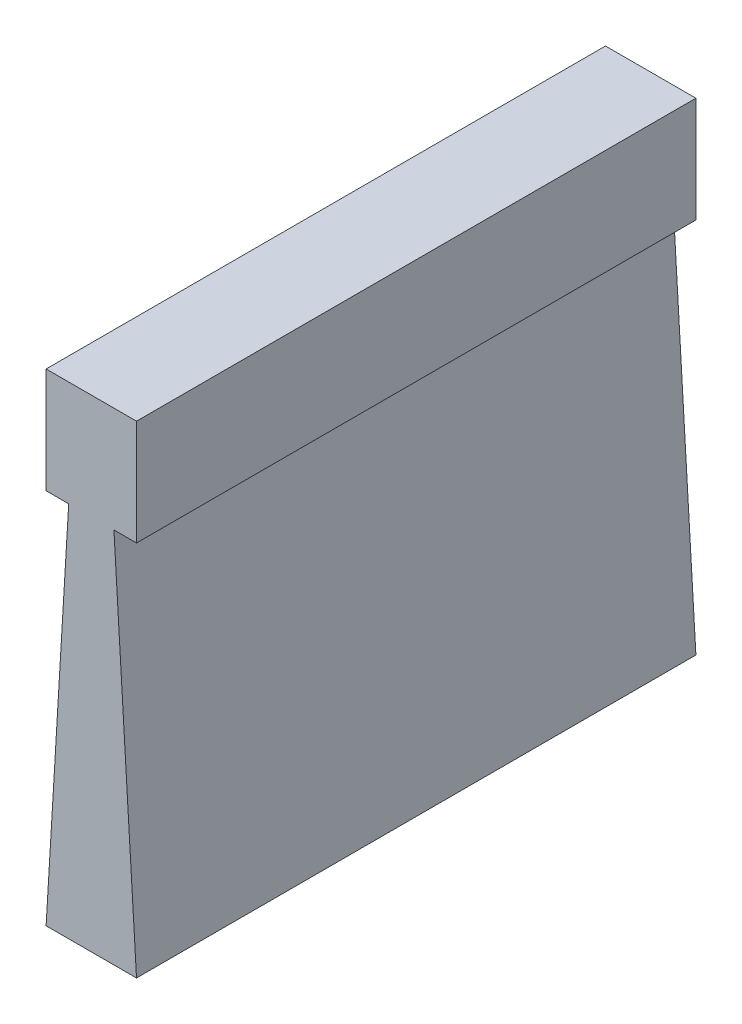
ISO-10303-21;
HEADER;
FILE_DESCRIPTION(('STEP AP214'),'2;1');
FILE_NAME('part.step','',(''),(''),'','','');
FILE_SCHEMA(('AUTOMOTIVE_DESIGN { 1 0 10303 214 1 1 1 1 }'));
ENDSEC;
DATA;
#1=APPLICATION_CONTEXT('core data for automotive mechanical design processes');
#2=APPLICATION_PROTOCOL_DEFINITION('international standard','automotive_design',2000,#1);
#3=PRODUCT_CONTEXT('',#1,'mechanical');
#4=PRODUCT('Part','Part','',(#3));
#5=PRODUCT_RELATED_PRODUCT_CATEGORY('part','',(#4));
#6=PRODUCT_DEFINITION_FORMATION('','',#4);
#7=PRODUCT_DEFINITION_CONTEXT('part definition',#1,'design');
#8=PRODUCT_DEFINITION('design','',#6,#7);
#9=PRODUCT_DEFINITION_SHAPE('','',#8);
#10=(LENGTH_UNIT() NAMED_UNIT(*) SI_UNIT(.MILLI.,.METRE.));
#11=(NAMED_UNIT(*) PLANE_ANGLE_UNIT() SI_UNIT($,.RADIAN.));
#12=(NAMED_UNIT(*) SI_UNIT($,.STERADIAN.) SOLID_ANGLE_UNIT());
#13=UNCERTAINTY_MEASURE_WITH_UNIT(LENGTH_MEASURE(1.E-05),#10,'distance_accuracy_value','');
#14=(GEOMETRIC_REPRESENTATION_CONTEXT(3) GLOBAL_UNCERTAINTY_ASSIGNED_CONTEXT((#13)) GLOBAL_UNIT_ASSIGNED_CONTEXT((#10,
#11,#12)) REPRESENTATION_CONTEXT('',''));
#15=CARTESIAN_POINT('',(0.,0.,0.));
#16=DIRECTION('',(0.,0.,1.));
#17=DIRECTION('',(1.,0.,0.));
#18=AXIS2_PLACEMENT_3D('',#15,#16,#17);
#19=CARTESIAN_POINT('',(-1.190625,0.,14.732));
#20=DIRECTION('',(0.998204845465779,-0.0598922907279466,0.));
#21=DIRECTION('',(0.0598922907279466,0.998204845465779,0.));
#22=AXIS2_PLACEMENT_3D('',#19,#20,#21);
#23=PLANE('',#22);
#24=DIRECTION('',(-0.0598922907279466,-0.998204845465779,0.));
#25=VECTOR('',#24,1.);
#26=CARTESIAN_POINT('',(-1.190625,0.,-14.732));
#27=LINE('',#26,#25);
#28=CARTESIAN_POINT('',(-1.190625,0.,-14.732));
#29=VERTEX_POINT('',#28);
#30=CARTESIAN_POINT('',(-2.38125,-19.84375,-14.732));
#31=VERTEX_POINT('',#30);
#32=EDGE_CURVE('E130',#29,#31,#27,.T.);
#33=ORIENTED_EDGE('',*,*,#32,.T.);
#34=DIRECTION('',(0.,0.,-1.));
#35=VECTOR('',#34,1.);
#36=CARTESIAN_POINT('',(-2.38125,-19.84375,14.732));
#37=LINE('',#36,#35);
#38=CARTESIAN_POINT('',(-2.38125,-19.84375,14.732));
#39=VERTEX_POINT('',#38);
#40=EDGE_CURVE('E11',#39,#31,#37,.T.);
#41=ORIENTED_EDGE('',*,*,#40,.F.);
#42=DIRECTION('',(-0.0598922907279466,-0.998204845465779,0.));
#43=VECTOR('',#42,1.);
#44=CARTESIAN_POINT('',(-1.190625,0.,14.732));
#45=LINE('',#44,#43);
#46=CARTESIAN_POINT('',(-1.190625,0.,14.732));
#47=VERTEX_POINT('',#46);
#48=EDGE_CURVE('E144',#47,#39,#45,.T.);
#49=ORIENTED_EDGE('',*,*,#48,.F.);
#50=DIRECTION('',(0.,0.,-1.));
#51=VECTOR('',#50,1.);
#52=CARTESIAN_POINT('',(-1.190625,0.,14.732));
#53=LINE('',#52,#51);
#54=EDGE_CURVE('E126',#47,#29,#53,.T.);
#55=ORIENTED_EDGE('',*,*,#54,.T.);
#56=EDGE_LOOP('',(#33,#41,#49,#55));
#57=FACE_BOUND('',#56,.T.);
#58=ADVANCED_FACE('F34',(#57),#23,.F.);
#59=CARTESIAN_POINT('',(-2.38125,-19.84375,14.732));
#60=DIRECTION('',(0.,1.,0.));
#61=DIRECTION('',(0.,0.,1.));
#62=AXIS2_PLACEMENT_3D('',#59,#60,#61);
#63=PLANE('',#62);
#64=DIRECTION('',(1.,0.,0.));
#65=VECTOR('',#64,1.);
#66=CARTESIAN_POINT('',(-2.38125,-19.84375,-14.732));
#67=LINE('',#66,#65);
#68=CARTESIAN_POINT('',(2.38125,-19.84375,-14.732));
#69=VERTEX_POINT('',#68);
#70=EDGE_CURVE('E133',#31,#69,#67,.T.);
#71=ORIENTED_EDGE('',*,*,#70,.T.);
#72=DIRECTION('',(0.,0.,-1.));
#73=VECTOR('',#72,1.);
#74=CARTESIAN_POINT('',(2.38125,-19.84375,14.732));
#75=LINE('',#74,#73);
#76=CARTESIAN_POINT('',(2.38125,-19.84375,14.732));
#77=VERTEX_POINT('',#76);
#78=EDGE_CURVE('E42',#77,#69,#75,.T.);
#79=ORIENTED_EDGE('',*,*,#78,.F.);
#80=DIRECTION('',(1.,0.,0.));
#81=VECTOR('',#80,1.);
#82=CARTESIAN_POINT('',(-2.38125,-19.84375,14.732));
#83=LINE('',#82,#81);
#84=EDGE_CURVE('E93',#39,#77,#83,.T.);
#85=ORIENTED_EDGE('',*,*,#84,.F.);
#86=ORIENTED_EDGE('',*,*,#40,.T.);
#87=EDGE_LOOP('',(#71,#79,#85,#86));
#88=FACE_BOUND('',#87,.T.);
#89=ADVANCED_FACE('F179',(#88),#63,.F.);
#90=CARTESIAN_POINT('',(1.190625,0.,14.732));
#91=DIRECTION('',(-0.998204845465779,-0.0598922907279469,0.));
#92=DIRECTION('',(0.0598922907279469,-0.998204845465779,0.));
#93=AXIS2_PLACEMENT_3D('',#90,#91,#92);
#94=PLANE('',#93);
#95=DIRECTION('',(-0.0598922907279469,0.998204845465779,0.));
#96=VECTOR('',#95,1.);
#97=CARTESIAN_POINT('',(1.190625,0.,-14.732));
#98=LINE('',#97,#96);
#99=CARTESIAN_POINT('',(1.190625,0.,-14.732));
#100=VERTEX_POINT('',#99);
#101=EDGE_CURVE('E135',#69,#100,#98,.T.);
#102=ORIENTED_EDGE('',*,*,#101,.T.);
#103=DIRECTION('',(0.,0.,-1.));
#104=VECTOR('',#103,1.);
#105=CARTESIAN_POINT('',(1.190625,0.,14.732));
#106=LINE('',#105,#104);
#107=CARTESIAN_POINT('',(1.190625,0.,14.732));
#108=VERTEX_POINT('',#107);
#109=EDGE_CURVE('E151',#108,#100,#106,.T.);
#110=ORIENTED_EDGE('',*,*,#109,.F.);
#111=DIRECTION('',(-0.0598922907279469,0.998204845465779,0.));
#112=VECTOR('',#111,1.);
#113=CARTESIAN_POINT('',(1.190625,0.,14.732));
#114=LINE('',#113,#112);
#115=EDGE_CURVE('E159',#77,#108,#114,.T.);
#116=ORIENTED_EDGE('',*,*,#115,.F.);
#117=ORIENTED_EDGE('',*,*,#78,.T.);
#118=EDGE_LOOP('',(#102,#110,#116,#117));
#119=FACE_BOUND('',#118,.T.);
#120=ADVANCED_FACE('F157',(#119),#94,.F.);
#121=CARTESIAN_POINT('',(1.190625,0.,14.732));
#122=DIRECTION('',(0.,1.,0.));
#123=DIRECTION('',(-1.,0.,0.));
#124=AXIS2_PLACEMENT_3D('',#121,#122,#123);
#125=PLANE('',#124);
#126=DIRECTION('',(1.,0.,0.));
#127=VECTOR('',#126,1.);
#128=CARTESIAN_POINT('',(1.190625,0.,-14.732));
#129=LINE('',#128,#127);
#130=CARTESIAN_POINT('',(2.38125,0.,-14.732));
#131=VERTEX_POINT('',#130);
#132=EDGE_CURVE('E137',#100,#131,#129,.T.);
#133=ORIENTED_EDGE('',*,*,#132,.T.);
#134=DIRECTION('',(0.,0.,-1.));
#135=VECTOR('',#134,1.);
#136=CARTESIAN_POINT('',(2.38125,0.,14.732));
#137=LINE('',#136,#135);
#138=CARTESIAN_POINT('',(2.38125,0.,14.732));
#139=VERTEX_POINT('',#138);
#140=EDGE_CURVE('E148',#139,#131,#137,.T.);
#141=ORIENTED_EDGE('',*,*,#140,.F.);
#142=DIRECTION('',(1.,0.,0.));
#143=VECTOR('',#142,1.);
#144=CARTESIAN_POINT('',(1.190625,0.,14.732));
#145=LINE('',#144,#143);
#146=EDGE_CURVE('E171',#108,#139,#145,.T.);
#147=ORIENTED_EDGE('',*,*,#146,.F.);
#148=ORIENTED_EDGE('',*,*,#109,.T.);
#149=EDGE_LOOP('',(#133,#141,#147,#148));
#150=FACE_BOUND('',#149,.T.);
#151=ADVANCED_FACE('F167',(#150),#125,.F.);
#152=CARTESIAN_POINT('',(2.38125,5.55625,14.732));
#153=DIRECTION('',(-1.,0.,0.));
#154=DIRECTION('',(0.,0.,1.));
#155=AXIS2_PLACEMENT_3D('',#152,#153,#154);
#156=PLANE('',#155);
#157=DIRECTION('',(0.,1.,0.));
#158=VECTOR('',#157,1.);
#159=CARTESIAN_POINT('',(2.38125,5.55625,-14.732));
#160=LINE('',#159,#158);
#161=CARTESIAN_POINT('',(2.38125,5.55625,-14.732));
#162=VERTEX_POINT('',#161);
#163=EDGE_CURVE('E139',#131,#162,#160,.T.);
#164=ORIENTED_EDGE('',*,*,#163,.T.);
#165=DIRECTION('',(0.,0.,-1.));
#166=VECTOR('',#165,1.);
#167=CARTESIAN_POINT('',(2.38125,5.55625,14.732));
#168=LINE('',#167,#166);
#169=CARTESIAN_POINT('',(2.38125,5.55625,14.732));
#170=VERTEX_POINT('',#169);
#171=EDGE_CURVE('E121',#170,#162,#168,.T.);
#172=ORIENTED_EDGE('',*,*,#171,.F.);
#173=DIRECTION('',(0.,1.,0.));
#174=VECTOR('',#173,1.);
#175=CARTESIAN_POINT('',(2.38125,5.55625,14.732));
#176=LINE('',#175,#174);
#177=EDGE_CURVE('E112',#139,#170,#176,.T.);
#178=ORIENTED_EDGE('',*,*,#177,.F.);
#179=ORIENTED_EDGE('',*,*,#140,.T.);
#180=EDGE_LOOP('',(#164,#172,#178,#179));
#181=FACE_BOUND('',#180,.T.);
#182=ADVANCED_FACE('F170',(#181),#156,.F.);
#183=CARTESIAN_POINT('',(-2.38125,5.55625,14.732));
#184=DIRECTION('',(0.,-1.,0.));
#185=DIRECTION('',(0.,0.,-1.));
#186=AXIS2_PLACEMENT_3D('',#183,#184,#185);
#187=PLANE('',#186);
#188=DIRECTION('',(-1.,0.,0.));
#189=VECTOR('',#188,1.);
#190=CARTESIAN_POINT('',(-2.38125,5.55625,-14.732));
#191=LINE('',#190,#189);
#192=CARTESIAN_POINT('',(-2.38125,5.55625,-14.732));
#193=VERTEX_POINT('',#192);
#194=EDGE_CURVE('E120',#162,#193,#191,.T.);
#195=ORIENTED_EDGE('',*,*,#194,.T.);
#196=DIRECTION('',(0.,0.,-1.));
#197=VECTOR('',#196,1.);
#198=CARTESIAN_POINT('',(-2.38125,5.55625,14.732));
#199=LINE('',#198,#197);
#200=CARTESIAN_POINT('',(-2.38125,5.55625,14.732));
#201=VERTEX_POINT('',#200);
#202=EDGE_CURVE('E117',#201,#193,#199,.T.);
#203=ORIENTED_EDGE('',*,*,#202,.F.);
#204=DIRECTION('',(-1.,0.,0.));
#205=VECTOR('',#204,1.);
#206=CARTESIAN_POINT('',(-2.38125,5.55625,14.732));
#207=LINE('',#206,#205);
#208=EDGE_CURVE('E106',#170,#201,#207,.T.);
#209=ORIENTED_EDGE('',*,*,#208,.F.);
#210=ORIENTED_EDGE('',*,*,#171,.T.);
#211=EDGE_LOOP('',(#195,#203,#209,#210));
#212=FACE_BOUND('',#211,.T.);
#213=ADVANCED_FACE('F118',(#212),#187,.F.);
#214=CARTESIAN_POINT('',(-2.38125,0.,14.732));
#215=DIRECTION('',(1.,0.,0.));
#216=DIRECTION('',(0.,0.,-1.));
#217=AXIS2_PLACEMENT_3D('',#214,#215,#216);
#218=PLANE('',#217);
#219=DIRECTION('',(0.,-1.,0.));
#220=VECTOR('',#219,1.);
#221=CARTESIAN_POINT('',(-2.38125,0.,-14.732));
#222=LINE('',#221,#220);
#223=CARTESIAN_POINT('',(-2.38125,0.,-14.732));
#224=VERTEX_POINT('',#223);
#225=EDGE_CURVE('E79',#193,#224,#222,.T.);
#226=ORIENTED_EDGE('',*,*,#225,.T.);
#227=DIRECTION('',(0.,0.,-1.));
#228=VECTOR('',#227,1.);
#229=CARTESIAN_POINT('',(-2.38125,0.,14.732));
#230=LINE('',#229,#228);
#231=CARTESIAN_POINT('',(-2.38125,0.,14.732));
#232=VERTEX_POINT('',#231);
#233=EDGE_CURVE('E122',#232,#224,#230,.T.);
#234=ORIENTED_EDGE('',*,*,#233,.F.);
#235=DIRECTION('',(0.,-1.,0.));
#236=VECTOR('',#235,1.);
#237=CARTESIAN_POINT('',(-2.38125,0.,14.732));
#238=LINE('',#237,#236);
#239=EDGE_CURVE('E110',#201,#232,#238,.T.);
#240=ORIENTED_EDGE('',*,*,#239,.F.);
#241=ORIENTED_EDGE('',*,*,#202,.T.);
#242=EDGE_LOOP('',(#226,#234,#240,#241));
#243=FACE_BOUND('',#242,.T.);
#244=ADVANCED_FACE('F124',(#243),#218,.F.);
#245=CARTESIAN_POINT('',(-1.190625,0.,14.732));
#246=DIRECTION('',(0.,1.,0.));
#247=DIRECTION('',(-1.,0.,0.));
#248=AXIS2_PLACEMENT_3D('',#245,#246,#247);
#249=PLANE('',#248);
#250=DIRECTION('',(1.,0.,0.));
#251=VECTOR('',#250,1.);
#252=CARTESIAN_POINT('',(-1.190625,0.,-14.732));
#253=LINE('',#252,#251);
#254=EDGE_CURVE('E85',#224,#29,#253,.T.);
#255=ORIENTED_EDGE('',*,*,#254,.T.);
#256=ORIENTED_EDGE('',*,*,#54,.F.);
#257=DIRECTION('',(1.,0.,0.));
#258=VECTOR('',#257,1.);
#259=CARTESIAN_POINT('',(-1.190625,0.,14.732));
#260=LINE('',#259,#258);
#261=EDGE_CURVE('E50',#232,#47,#260,.T.);
#262=ORIENTED_EDGE('',*,*,#261,.F.);
#263=ORIENTED_EDGE('',*,*,#233,.T.);
#264=EDGE_LOOP('',(#255,#256,#262,#263));
#265=FACE_BOUND('',#264,.T.);
#266=ADVANCED_FACE('F195',(#265),#249,.F.);
#267=CARTESIAN_POINT('',(-2.38125,-19.84375,14.732));
#268=DIRECTION('',(0.,0.,1.));
#269=DIRECTION('',(1.,0.,0.));
#270=AXIS2_PLACEMENT_3D('',#267,#268,#269);
#271=PLANE('',#270);
#272=ORIENTED_EDGE('',*,*,#48,.T.);
#273=ORIENTED_EDGE('',*,*,#84,.T.);
#274=ORIENTED_EDGE('',*,*,#115,.T.);
#275=ORIENTED_EDGE('',*,*,#146,.T.);
#276=ORIENTED_EDGE('',*,*,#177,.T.);
#277=ORIENTED_EDGE('',*,*,#208,.T.);
#278=ORIENTED_EDGE('',*,*,#239,.T.);
#279=ORIENTED_EDGE('',*,*,#261,.T.);
#280=EDGE_LOOP('',(#272,#273,#274,#275,#276,#277,#278,#279));
#281=FACE_BOUND('',#280,.T.);
#282=ADVANCED_FACE('F108',(#281),#271,.T.);
#283=CARTESIAN_POINT('',(-2.38125,-19.84375,-14.732));
#284=DIRECTION('',(0.,0.,1.));
#285=DIRECTION('',(1.,0.,0.));
#286=AXIS2_PLACEMENT_3D('',#283,#284,#285);
#287=PLANE('',#286);
#288=ORIENTED_EDGE('',*,*,#32,.F.);
#289=ORIENTED_EDGE('',*,*,#254,.F.);
#290=ORIENTED_EDGE('',*,*,#225,.F.);
#291=ORIENTED_EDGE('',*,*,#194,.F.);
#292=ORIENTED_EDGE('',*,*,#163,.F.);
#293=ORIENTED_EDGE('',*,*,#132,.F.);
#294=ORIENTED_EDGE('',*,*,#101,.F.);
#295=ORIENTED_EDGE('',*,*,#70,.F.);
#296=EDGE_LOOP('',(#288,#289,#290,#291,#292,#293,#294,#295));
#297=FACE_BOUND('',#296,.T.);
#298=ADVANCED_FACE('F163',(#297),#287,.F.);
#299=CLOSED_SHELL('',(#58,#89,#120,#151,#182,#213,#244,#266,#282,#298));
#300=MANIFOLD_SOLID_BREP('B2',#299);
#301=ADVANCED_BREP_SHAPE_REPRESENTATION('',(#18,#300),#14);
#302=SHAPE_DEFINITION_REPRESENTATION(#9,#301);
ENDSEC;
END-ISO-10303-21;
